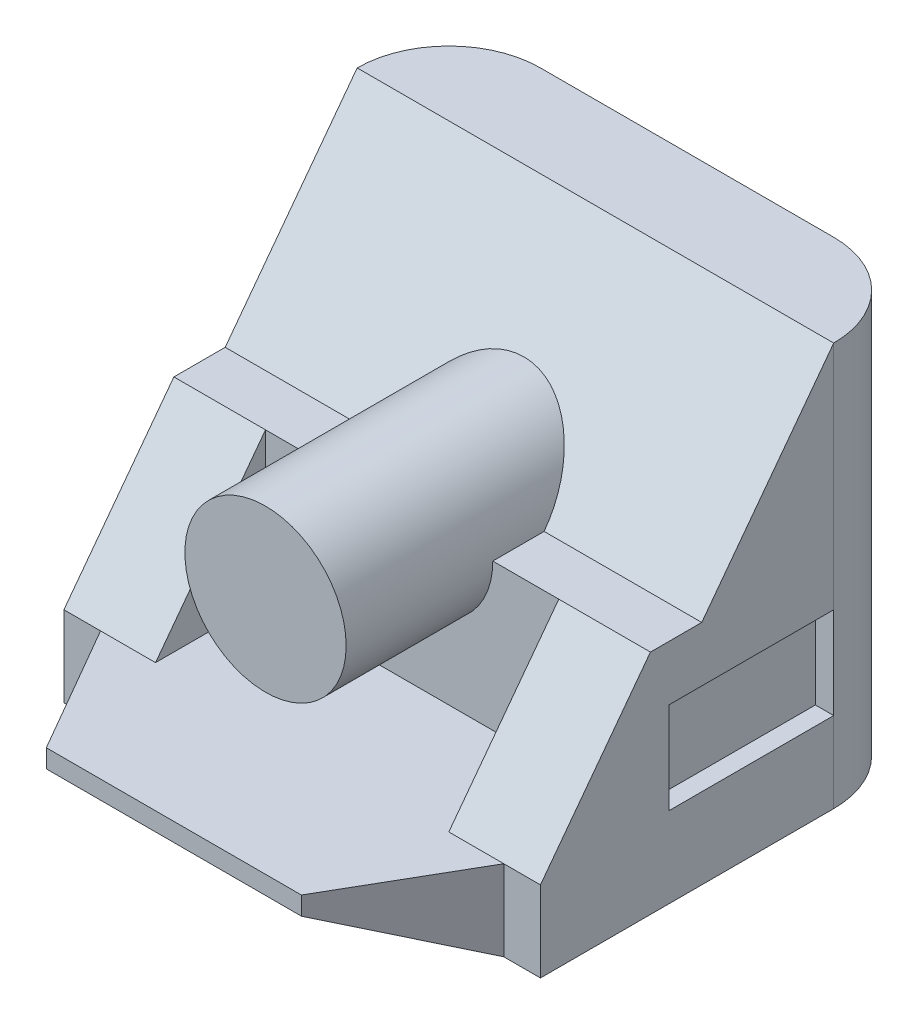
ISO-10303-21;
HEADER;
FILE_DESCRIPTION(('STEP AP214'),'2;1');
FILE_NAME('part.step','',(''),(''),'','','');
FILE_SCHEMA(('AUTOMOTIVE_DESIGN { 1 0 10303 214 1 1 1 1 }'));
ENDSEC;
DATA;
#1=APPLICATION_CONTEXT('core data for automotive mechanical design processes');
#2=APPLICATION_PROTOCOL_DEFINITION('international standard','automotive_design',2000,#1);
#3=PRODUCT_CONTEXT('',#1,'mechanical');
#4=PRODUCT('Part','Part','',(#3));
#5=PRODUCT_RELATED_PRODUCT_CATEGORY('part','',(#4));
#6=PRODUCT_DEFINITION_FORMATION('','',#4);
#7=PRODUCT_DEFINITION_CONTEXT('part definition',#1,'design');
#8=PRODUCT_DEFINITION('design','',#6,#7);
#9=PRODUCT_DEFINITION_SHAPE('','',#8);
#10=(LENGTH_UNIT() NAMED_UNIT(*) SI_UNIT(.MILLI.,.METRE.));
#11=(NAMED_UNIT(*) PLANE_ANGLE_UNIT() SI_UNIT($,.RADIAN.));
#12=(NAMED_UNIT(*) SI_UNIT($,.STERADIAN.) SOLID_ANGLE_UNIT());
#13=UNCERTAINTY_MEASURE_WITH_UNIT(LENGTH_MEASURE(1.E-05),#10,'distance_accuracy_value','');
#14=(GEOMETRIC_REPRESENTATION_CONTEXT(3) GLOBAL_UNCERTAINTY_ASSIGNED_CONTEXT((#13)) GLOBAL_UNIT_ASSIGNED_CONTEXT((#10,
#11,#12)) REPRESENTATION_CONTEXT('',''));
#15=CARTESIAN_POINT('',(0.,0.,0.));
#16=DIRECTION('',(0.,0.,1.));
#17=DIRECTION('',(1.,0.,0.));
#18=AXIS2_PLACEMENT_3D('',#15,#16,#17);
#19=CARTESIAN_POINT('',(130.,62.,61.));
#20=DIRECTION('',(0.,-1.,0.));
#21=DIRECTION('',(0.,0.,-1.));
#22=AXIS2_PLACEMENT_3D('',#19,#20,#21);
#23=PLANE('',#22);
#24=DIRECTION('',(-1.,0.,0.));
#25=VECTOR('',#24,1.);
#26=CARTESIAN_POINT('',(130.,62.,61.));
#27=LINE('',#26,#25);
#28=CARTESIAN_POINT('',(130.,62.,61.));
#29=VERTEX_POINT('',#28);
#30=CARTESIAN_POINT('',(87.,62.,61.));
#31=VERTEX_POINT('',#30);
#32=EDGE_CURVE('E190',#29,#31,#27,.T.);
#33=ORIENTED_EDGE('',*,*,#32,.T.);
#34=DIRECTION('',(0.,0.,1.));
#35=VECTOR('',#34,1.);
#36=CARTESIAN_POINT('',(87.,62.,-9.00357133746817));
#37=LINE('',#36,#35);
#38=CARTESIAN_POINT('',(87.,62.,75.));
#39=VERTEX_POINT('',#38);
#40=EDGE_CURVE('E173',#31,#39,#37,.T.);
#41=ORIENTED_EDGE('',*,*,#40,.T.);
#42=DIRECTION('',(-1.,0.,0.));
#43=VECTOR('',#42,1.);
#44=CARTESIAN_POINT('',(25.,62.,75.));
#45=LINE('',#44,#43);
#46=CARTESIAN_POINT('',(105.,62.,75.));
#47=VERTEX_POINT('',#46);
#48=EDGE_CURVE('E354',#47,#39,#45,.T.);
#49=ORIENTED_EDGE('',*,*,#48,.F.);
#50=DIRECTION('',(-1.,0.,0.));
#51=VECTOR('',#50,1.);
#52=CARTESIAN_POINT('',(130.,62.,75.));
#53=LINE('',#52,#51);
#54=CARTESIAN_POINT('',(130.,62.,75.));
#55=VERTEX_POINT('',#54);
#56=EDGE_CURVE('E203',#55,#47,#53,.T.);
#57=ORIENTED_EDGE('',*,*,#56,.F.);
#58=DIRECTION('',(0.,0.,1.));
#59=VECTOR('',#58,1.);
#60=CARTESIAN_POINT('',(130.,62.,61.));
#61=LINE('',#60,#59);
#62=EDGE_CURVE('E197',#29,#55,#61,.T.);
#63=ORIENTED_EDGE('',*,*,#62,.F.);
#64=EDGE_LOOP('',(#33,#41,#49,#57,#63));
#65=FACE_BOUND('',#64,.T.);
#66=ADVANCED_FACE('F31',(#65),#23,.F.);
#67=CARTESIAN_POINT('',(25.,-63.4400374531753,75.0000000000001));
#68=DIRECTION('',(0.,0.,-1.));
#69=DIRECTION('',(0.,1.,0.));
#70=AXIS2_PLACEMENT_3D('',#67,#68,#69);
#71=PLANE('',#70);
#72=CARTESIAN_POINT('',(65.,62.,75.));
#73=DIRECTION('',(0.,0.,-1.));
#74=DIRECTION('',(0.,1.,0.));
#75=AXIS2_PLACEMENT_3D('',#72,#73,#74);
#76=CIRCLE('',#75,22.);
#77=CARTESIAN_POINT('',(43.,62.,75.));
#78=VERTEX_POINT('',#77);
#79=EDGE_CURVE('E11',#39,#78,#76,.T.);
#80=ORIENTED_EDGE('',*,*,#79,.T.);
#81=CARTESIAN_POINT('',(25.,62.,75.));
#82=VERTEX_POINT('',#81);
#83=EDGE_CURVE('E358',#78,#82,#45,.T.);
#84=ORIENTED_EDGE('',*,*,#83,.T.);
#85=DIRECTION('',(0.,1.,0.));
#86=VECTOR('',#85,1.);
#87=CARTESIAN_POINT('',(25.,-63.4400374531753,75.0000000000001));
#88=LINE('',#87,#86);
#89=CARTESIAN_POINT('',(25.,22.,75.));
#90=VERTEX_POINT('',#89);
#91=EDGE_CURVE('E350',#90,#82,#88,.T.);
#92=ORIENTED_EDGE('',*,*,#91,.F.);
#93=DIRECTION('',(-1.,0.,0.));
#94=VECTOR('',#93,1.);
#95=CARTESIAN_POINT('',(25.,22.,75.));
#96=LINE('',#95,#94);
#97=CARTESIAN_POINT('',(105.,22.,75.));
#98=VERTEX_POINT('',#97);
#99=EDGE_CURVE('E349',#98,#90,#96,.T.);
#100=ORIENTED_EDGE('',*,*,#99,.F.);
#101=DIRECTION('',(0.,1.,0.));
#102=VECTOR('',#101,1.);
#103=CARTESIAN_POINT('',(105.,-63.4400374531753,75.0000000000001));
#104=LINE('',#103,#102);
#105=EDGE_CURVE('E347',#98,#47,#104,.T.);
#106=ORIENTED_EDGE('',*,*,#105,.T.);
#107=ORIENTED_EDGE('',*,*,#48,.T.);
#108=EDGE_LOOP('',(#80,#84,#92,#100,#106,#107));
#109=FACE_BOUND('',#108,.T.);
#110=ADVANCED_FACE('F379',(#109),#71,.F.);
#111=CARTESIAN_POINT('',(130.,62.,75.));
#112=DIRECTION('',(0.,-0.6,-0.8));
#113=DIRECTION('',(0.,0.8,-0.6));
#114=AXIS2_PLACEMENT_3D('',#111,#112,#113);
#115=PLANE('',#114);
#116=ORIENTED_EDGE('',*,*,#56,.T.);
#117=DIRECTION('',(0.,-0.8,0.6));
#118=VECTOR('',#117,1.);
#119=CARTESIAN_POINT('',(105.,62.,75.));
#120=LINE('',#119,#118);
#121=CARTESIAN_POINT('',(105.,22.,105.));
#122=VERTEX_POINT('',#121);
#123=EDGE_CURVE('E40',#47,#122,#120,.T.);
#124=ORIENTED_EDGE('',*,*,#123,.T.);
#125=DIRECTION('',(-1.,0.,0.));
#126=VECTOR('',#125,1.);
#127=CARTESIAN_POINT('',(130.,22.,105.));
#128=LINE('',#127,#126);
#129=CARTESIAN_POINT('',(120.,22.,105.));
#130=VERTEX_POINT('',#129);
#131=EDGE_CURVE('E252',#130,#122,#128,.T.);
#132=ORIENTED_EDGE('',*,*,#131,.F.);
#133=CARTESIAN_POINT('',(130.,22.,105.));
#134=VERTEX_POINT('',#133);
#135=EDGE_CURVE('E263',#134,#130,#128,.T.);
#136=ORIENTED_EDGE('',*,*,#135,.F.);
#137=DIRECTION('',(0.,-0.8,0.6));
#138=VECTOR('',#137,1.);
#139=CARTESIAN_POINT('',(130.,62.,75.));
#140=LINE('',#139,#138);
#141=EDGE_CURVE('E291',#55,#134,#140,.T.);
#142=ORIENTED_EDGE('',*,*,#141,.F.);
#143=EDGE_LOOP('',(#116,#124,#132,#136,#142));
#144=FACE_BOUND('',#143,.T.);
#145=ADVANCED_FACE('F250',(#144),#115,.F.);
#146=CARTESIAN_POINT('',(130.,0.,105.));
#147=DIRECTION('',(0.,1.,0.));
#148=DIRECTION('',(0.,0.,1.));
#149=AXIS2_PLACEMENT_3D('',#146,#147,#148);
#150=PLANE('',#149);
#151=DIRECTION('',(0.,0.,-1.));
#152=VECTOR('',#151,1.);
#153=CARTESIAN_POINT('',(0.,0.,105.));
#154=LINE('',#153,#152);
#155=CARTESIAN_POINT('',(0.,0.,105.));
#156=VERTEX_POINT('',#155);
#157=CARTESIAN_POINT('',(0.,0.,25.));
#158=VERTEX_POINT('',#157);
#159=EDGE_CURVE('E287',#156,#158,#154,.T.);
#160=ORIENTED_EDGE('',*,*,#159,.T.);
#161=CARTESIAN_POINT('',(25.,0.,25.));
#162=DIRECTION('',(0.,1.,0.));
#163=DIRECTION('',(0.,0.,1.));
#164=AXIS2_PLACEMENT_3D('',#161,#162,#163);
#165=CIRCLE('',#164,25.);
#166=CARTESIAN_POINT('',(25.,0.,0.));
#167=VERTEX_POINT('',#166);
#168=EDGE_CURVE('E225',#158,#167,#165,.F.);
#169=ORIENTED_EDGE('',*,*,#168,.T.);
#170=DIRECTION('',(-1.,0.,0.));
#171=VECTOR('',#170,1.);
#172=CARTESIAN_POINT('',(130.,0.,0.));
#173=LINE('',#172,#171);
#174=CARTESIAN_POINT('',(105.,0.,0.));
#175=VERTEX_POINT('',#174);
#176=EDGE_CURVE('E209',#175,#167,#173,.T.);
#177=ORIENTED_EDGE('',*,*,#176,.F.);
#178=CARTESIAN_POINT('',(105.,0.,25.));
#179=DIRECTION('',(0.,1.,0.));
#180=DIRECTION('',(0.,0.,1.));
#181=AXIS2_PLACEMENT_3D('',#178,#179,#180);
#182=CIRCLE('',#181,25.);
#183=CARTESIAN_POINT('',(130.,0.,25.));
#184=VERTEX_POINT('',#183);
#185=EDGE_CURVE('E223',#175,#184,#182,.F.);
#186=ORIENTED_EDGE('',*,*,#185,.T.);
#187=DIRECTION('',(0.,0.,-1.));
#188=VECTOR('',#187,1.);
#189=CARTESIAN_POINT('',(130.,0.,105.));
#190=LINE('',#189,#188);
#191=CARTESIAN_POINT('',(130.,0.,105.));
#192=VERTEX_POINT('',#191);
#193=EDGE_CURVE('E281',#192,#184,#190,.T.);
#194=ORIENTED_EDGE('',*,*,#193,.F.);
#195=DIRECTION('',(-1.,0.,0.));
#196=VECTOR('',#195,1.);
#197=CARTESIAN_POINT('',(130.,0.,105.));
#198=LINE('',#197,#196);
#199=CARTESIAN_POINT('',(120.,0.,105.));
#200=VERTEX_POINT('',#199);
#201=EDGE_CURVE('E274',#192,#200,#198,.T.);
#202=ORIENTED_EDGE('',*,*,#201,.T.);
#203=CARTESIAN_POINT('',(9.99999999999999,0.,105.));
#204=VERTEX_POINT('',#203);
#205=EDGE_CURVE('E277',#200,#204,#198,.T.);
#206=ORIENTED_EDGE('',*,*,#205,.T.);
#207=DIRECTION('',(-1.,0.,0.));
#208=VECTOR('',#207,1.);
#209=CARTESIAN_POINT('',(130.,0.,105.));
#210=LINE('',#209,#208);
#211=EDGE_CURVE('E304',#204,#156,#210,.T.);
#212=ORIENTED_EDGE('',*,*,#211,.T.);
#213=EDGE_LOOP('',(#160,#169,#177,#186,#194,#202,#206,#212));
#214=FACE_BOUND('',#213,.T.);
#215=ADVANCED_FACE('F548',(#214),#150,.F.);
#216=CARTESIAN_POINT('',(130.,0.,0.));
#217=DIRECTION('',(0.,0.,1.));
#218=DIRECTION('',(1.,0.,0.));
#219=AXIS2_PLACEMENT_3D('',#216,#217,#218);
#220=PLANE('',#219);
#221=ORIENTED_EDGE('',*,*,#176,.T.);
#222=DIRECTION('',(0.,1.,0.));
#223=VECTOR('',#222,1.);
#224=CARTESIAN_POINT('',(25.,0.,0.));
#225=LINE('',#224,#223);
#226=CARTESIAN_POINT('',(25.,110.,0.));
#227=VERTEX_POINT('',#226);
#228=EDGE_CURVE('E214',#167,#227,#225,.T.);
#229=ORIENTED_EDGE('',*,*,#228,.T.);
#230=DIRECTION('',(-1.,0.,0.));
#231=VECTOR('',#230,1.);
#232=CARTESIAN_POINT('',(130.,110.,0.));
#233=LINE('',#232,#231);
#234=CARTESIAN_POINT('',(105.,110.,0.));
#235=VERTEX_POINT('',#234);
#236=EDGE_CURVE('E201',#235,#227,#233,.T.);
#237=ORIENTED_EDGE('',*,*,#236,.F.);
#238=DIRECTION('',(0.,1.,0.));
#239=VECTOR('',#238,1.);
#240=CARTESIAN_POINT('',(105.,0.,0.));
#241=LINE('',#240,#239);
#242=EDGE_CURVE('E212',#235,#175,#241,.F.);
#243=ORIENTED_EDGE('',*,*,#242,.T.);
#244=EDGE_LOOP('',(#221,#229,#237,#243));
#245=FACE_BOUND('',#244,.T.);
#246=ADVANCED_FACE('F632',(#245),#220,.F.);
#247=CARTESIAN_POINT('',(130.,110.,0.));
#248=DIRECTION('',(0.,-1.,0.));
#249=DIRECTION('',(0.,0.,-1.));
#250=AXIS2_PLACEMENT_3D('',#247,#248,#249);
#251=PLANE('',#250);
#252=ORIENTED_EDGE('',*,*,#236,.T.);
#253=CARTESIAN_POINT('',(25.,110.,25.));
#254=DIRECTION('',(0.,-1.,0.));
#255=DIRECTION('',(0.,0.,-1.));
#256=AXIS2_PLACEMENT_3D('',#253,#254,#255);
#257=CIRCLE('',#256,25.);
#258=CARTESIAN_POINT('',(0.,110.,25.));
#259=VERTEX_POINT('',#258);
#260=EDGE_CURVE('E219',#227,#259,#257,.F.);
#261=ORIENTED_EDGE('',*,*,#260,.T.);
#262=DIRECTION('',(-1.,0.,0.));
#263=VECTOR('',#262,1.);
#264=CARTESIAN_POINT('',(130.,110.,25.));
#265=LINE('',#264,#263);
#266=CARTESIAN_POINT('',(130.,110.,25.));
#267=VERTEX_POINT('',#266);
#268=EDGE_CURVE('E198',#267,#259,#265,.T.);
#269=ORIENTED_EDGE('',*,*,#268,.F.);
#270=CARTESIAN_POINT('',(105.,110.,25.));
#271=DIRECTION('',(0.,-1.,0.));
#272=DIRECTION('',(0.,0.,-1.));
#273=AXIS2_PLACEMENT_3D('',#270,#271,#272);
#274=CIRCLE('',#273,25.);
#275=EDGE_CURVE('E217',#267,#235,#274,.F.);
#276=ORIENTED_EDGE('',*,*,#275,.T.);
#277=EDGE_LOOP('',(#252,#261,#269,#276));
#278=FACE_BOUND('',#277,.T.);
#279=ADVANCED_FACE('F397',(#278),#251,.F.);
#280=CARTESIAN_POINT('',(130.,110.,25.));
#281=DIRECTION('',(0.,-0.6,-0.8));
#282=DIRECTION('',(0.,0.8,-0.6));
#283=AXIS2_PLACEMENT_3D('',#280,#281,#282);
#284=PLANE('',#283);
#285=CARTESIAN_POINT('',(43.,62.,61.));
#286=VERTEX_POINT('',#285);
#287=CARTESIAN_POINT('',(0.,62.,61.));
#288=VERTEX_POINT('',#287);
#289=EDGE_CURVE('E193',#286,#288,#27,.T.);
#290=ORIENTED_EDGE('',*,*,#289,.F.);
#291=CARTESIAN_POINT('',(65.,62.,61.));
#292=DIRECTION('',(0.,-0.6,-0.8));
#293=DIRECTION('',(0.,-0.8,0.6));
#294=AXIS2_PLACEMENT_3D('',#291,#292,#293);
#295=ELLIPSE('',#294,27.5,22.);
#296=EDGE_CURVE('E177',#31,#286,#295,.F.);
#297=ORIENTED_EDGE('',*,*,#296,.F.);
#298=ORIENTED_EDGE('',*,*,#32,.F.);
#299=DIRECTION('',(0.,-0.8,0.6));
#300=VECTOR('',#299,1.);
#301=CARTESIAN_POINT('',(130.,110.,25.));
#302=LINE('',#301,#300);
#303=EDGE_CURVE('E295',#267,#29,#302,.T.);
#304=ORIENTED_EDGE('',*,*,#303,.F.);
#305=ORIENTED_EDGE('',*,*,#268,.T.);
#306=DIRECTION('',(0.,-0.8,0.6));
#307=VECTOR('',#306,1.);
#308=CARTESIAN_POINT('',(0.,110.,25.));
#309=LINE('',#308,#307);
#310=EDGE_CURVE('E285',#259,#288,#309,.T.);
#311=ORIENTED_EDGE('',*,*,#310,.T.);
#312=EDGE_LOOP('',(#290,#297,#298,#304,#305,#311));
#313=FACE_BOUND('',#312,.T.);
#314=ADVANCED_FACE('F188',(#313),#284,.F.);
#315=ORIENTED_EDGE('',*,*,#83,.F.);
#316=DIRECTION('',(0.,0.,1.));
#317=VECTOR('',#316,1.);
#318=CARTESIAN_POINT('',(43.,62.,-9.00357133746817));
#319=LINE('',#318,#317);
#320=EDGE_CURVE('E183',#78,#286,#319,.F.);
#321=ORIENTED_EDGE('',*,*,#320,.T.);
#322=ORIENTED_EDGE('',*,*,#289,.T.);
#323=DIRECTION('',(0.,0.,1.));
#324=VECTOR('',#323,1.);
#325=CARTESIAN_POINT('',(0.,62.,61.));
#326=LINE('',#325,#324);
#327=CARTESIAN_POINT('',(0.,62.,75.));
#328=VERTEX_POINT('',#327);
#329=EDGE_CURVE('E282',#288,#328,#326,.T.);
#330=ORIENTED_EDGE('',*,*,#329,.T.);
#331=EDGE_CURVE('E266',#82,#328,#53,.T.);
#332=ORIENTED_EDGE('',*,*,#331,.F.);
#333=EDGE_LOOP('',(#315,#321,#322,#330,#332));
#334=FACE_BOUND('',#333,.T.);
#335=ADVANCED_FACE('F381',(#334),#23,.F.);
#336=CARTESIAN_POINT('',(25.,22.,105.));
#337=VERTEX_POINT('',#336);
#338=CARTESIAN_POINT('',(9.99999999999999,22.,105.));
#339=VERTEX_POINT('',#338);
#340=EDGE_CURVE('E264',#337,#339,#128,.T.);
#341=ORIENTED_EDGE('',*,*,#340,.F.);
#342=DIRECTION('',(0.,0.8,-0.6));
#343=VECTOR('',#342,1.);
#344=CARTESIAN_POINT('',(25.,62.,75.));
#345=LINE('',#344,#343);
#346=EDGE_CURVE('E242',#337,#82,#345,.T.);
#347=ORIENTED_EDGE('',*,*,#346,.T.);
#348=ORIENTED_EDGE('',*,*,#331,.T.);
#349=DIRECTION('',(0.,-0.8,0.6));
#350=VECTOR('',#349,1.);
#351=CARTESIAN_POINT('',(0.,62.,75.));
#352=LINE('',#351,#350);
#353=CARTESIAN_POINT('',(0.,22.,105.));
#354=VERTEX_POINT('',#353);
#355=EDGE_CURVE('E278',#328,#354,#352,.T.);
#356=ORIENTED_EDGE('',*,*,#355,.T.);
#357=DIRECTION('',(-1.,0.,0.));
#358=VECTOR('',#357,1.);
#359=CARTESIAN_POINT('',(0.,22.,105.));
#360=LINE('',#359,#358);
#361=EDGE_CURVE('E315',#339,#354,#360,.T.);
#362=ORIENTED_EDGE('',*,*,#361,.F.);
#363=EDGE_LOOP('',(#341,#347,#348,#356,#362));
#364=FACE_BOUND('',#363,.T.);
#365=ADVANCED_FACE('F390',(#364),#115,.F.);
#366=CARTESIAN_POINT('',(130.,22.,105.));
#367=DIRECTION('',(0.,-1.,0.));
#368=DIRECTION('',(0.,0.,-1.));
#369=AXIS2_PLACEMENT_3D('',#366,#367,#368);
#370=PLANE('',#369);
#371=ORIENTED_EDGE('',*,*,#131,.T.);
#372=DIRECTION('',(0.,0.,-1.));
#373=VECTOR('',#372,1.);
#374=CARTESIAN_POINT('',(105.,22.,75.0000000000001));
#375=LINE('',#374,#373);
#376=EDGE_CURVE('E260',#122,#98,#375,.T.);
#377=ORIENTED_EDGE('',*,*,#376,.T.);
#378=ORIENTED_EDGE('',*,*,#99,.T.);
#379=DIRECTION('',(0.,0.,1.));
#380=VECTOR('',#379,1.);
#381=CARTESIAN_POINT('',(25.,22.,75.0000000000001));
#382=LINE('',#381,#380);
#383=EDGE_CURVE('E47',#90,#337,#382,.T.);
#384=ORIENTED_EDGE('',*,*,#383,.T.);
#385=ORIENTED_EDGE('',*,*,#340,.T.);
#386=DIRECTION('',(-0.500000000000004,0.,-0.866025403784436));
#387=VECTOR('',#386,1.);
#388=CARTESIAN_POINT('',(9.99999999999999,22.,105.));
#389=LINE('',#388,#387);
#390=CARTESIAN_POINT('',(30.2072594216371,22.,140.));
#391=VERTEX_POINT('',#390);
#392=EDGE_CURVE('E310',#391,#339,#389,.T.);
#393=ORIENTED_EDGE('',*,*,#392,.F.);
#394=DIRECTION('',(-1.,0.,0.));
#395=VECTOR('',#394,1.);
#396=CARTESIAN_POINT('',(130.,22.,140.));
#397=LINE('',#396,#395);
#398=CARTESIAN_POINT('',(99.7927405783629,22.,140.));
#399=VERTEX_POINT('',#398);
#400=EDGE_CURVE('E267',#399,#391,#397,.T.);
#401=ORIENTED_EDGE('',*,*,#400,.F.);
#402=DIRECTION('',(-0.500000000000004,0.,0.866025403784436));
#403=VECTOR('',#402,1.);
#404=CARTESIAN_POINT('',(120.,22.,105.));
#405=LINE('',#404,#403);
#406=EDGE_CURVE('E262',#130,#399,#405,.T.);
#407=ORIENTED_EDGE('',*,*,#406,.F.);
#408=EDGE_LOOP('',(#371,#377,#378,#384,#385,#393,#401,#407));
#409=FACE_BOUND('',#408,.T.);
#410=ADVANCED_FACE('F259',(#409),#370,.F.);
#411=CARTESIAN_POINT('',(130.,22.,140.));
#412=DIRECTION('',(0.,0.,-1.));
#413=DIRECTION('',(-1.,0.,0.));
#414=AXIS2_PLACEMENT_3D('',#411,#412,#413);
#415=PLANE('',#414);
#416=ORIENTED_EDGE('',*,*,#400,.T.);
#417=DIRECTION('',(0.,1.,0.));
#418=VECTOR('',#417,1.);
#419=CARTESIAN_POINT('',(30.2072594216371,-108.,140.));
#420=LINE('',#419,#418);
#421=CARTESIAN_POINT('',(30.2072594216371,17.,140.));
#422=VERTEX_POINT('',#421);
#423=EDGE_CURVE('E308',#422,#391,#420,.T.);
#424=ORIENTED_EDGE('',*,*,#423,.F.);
#425=DIRECTION('',(-1.,0.,0.));
#426=VECTOR('',#425,1.);
#427=CARTESIAN_POINT('',(130.,17.,140.));
#428=LINE('',#427,#426);
#429=CARTESIAN_POINT('',(99.7927405783629,17.,140.));
#430=VERTEX_POINT('',#429);
#431=EDGE_CURVE('E271',#430,#422,#428,.T.);
#432=ORIENTED_EDGE('',*,*,#431,.F.);
#433=DIRECTION('',(0.,1.,0.));
#434=VECTOR('',#433,1.);
#435=CARTESIAN_POINT('',(99.7927405783629,-108.,140.));
#436=LINE('',#435,#434);
#437=EDGE_CURVE('E299',#430,#399,#436,.T.);
#438=ORIENTED_EDGE('',*,*,#437,.T.);
#439=EDGE_LOOP('',(#416,#424,#432,#438));
#440=FACE_BOUND('',#439,.T.);
#441=ADVANCED_FACE('F412',(#440),#415,.F.);
#442=CARTESIAN_POINT('',(130.,17.,140.));
#443=DIRECTION('',(0.,0.899508158575998,-0.436903962736913));
#444=DIRECTION('',(0.,0.436903962736913,0.899508158575998));
#445=AXIS2_PLACEMENT_3D('',#442,#443,#444);
#446=PLANE('',#445);
#447=ORIENTED_EDGE('',*,*,#431,.T.);
#448=DIRECTION('',(-0.460885525173043,-0.387734613806772,-0.798277146072767));
#449=VECTOR('',#448,1.);
#450=CARTESIAN_POINT('',(51.404781046138,34.8330895891136,176.715184448175));
#451=LINE('',#450,#449);
#452=EDGE_CURVE('E239',#422,#204,#451,.T.);
#453=ORIENTED_EDGE('',*,*,#452,.T.);
#454=ORIENTED_EDGE('',*,*,#205,.F.);
#455=DIRECTION('',(-0.460885525173043,0.387734613806772,0.798277146072767));
#456=VECTOR('',#455,1.);
#457=CARTESIAN_POINT('',(106.209229704686,11.6019243445404,128.886314826995));
#458=LINE('',#457,#456);
#459=EDGE_CURVE('E233',#200,#430,#458,.T.);
#460=ORIENTED_EDGE('',*,*,#459,.T.);
#461=EDGE_LOOP('',(#447,#453,#454,#460));
#462=FACE_BOUND('',#461,.T.);
#463=ADVANCED_FACE('F414',(#462),#446,.F.);
#464=CARTESIAN_POINT('',(130.,0.,0.));
#465=DIRECTION('',(1.,0.,0.));
#466=DIRECTION('',(0.,0.,-1.));
#467=AXIS2_PLACEMENT_3D('',#464,#465,#466);
#468=PLANE('',#467);
#469=DIRECTION('',(0.,0.,-1.));
#470=VECTOR('',#469,1.);
#471=CARTESIAN_POINT('',(130.,22.,25.));
#472=LINE('',#471,#470);
#473=CARTESIAN_POINT('',(130.,22.,70.));
#474=VERTEX_POINT('',#473);
#475=CARTESIAN_POINT('',(130.,22.,25.));
#476=VERTEX_POINT('',#475);
#477=EDGE_CURVE('E55',#474,#476,#472,.T.);
#478=ORIENTED_EDGE('',*,*,#477,.F.);
#479=DIRECTION('',(0.,-1.,0.));
#480=VECTOR('',#479,1.);
#481=CARTESIAN_POINT('',(130.,47.,70.));
#482=LINE('',#481,#480);
#483=CARTESIAN_POINT('',(130.,47.,70.));
#484=VERTEX_POINT('',#483);
#485=EDGE_CURVE('E328',#484,#474,#482,.T.);
#486=ORIENTED_EDGE('',*,*,#485,.F.);
#487=DIRECTION('',(0.,0.,1.));
#488=VECTOR('',#487,1.);
#489=CARTESIAN_POINT('',(130.,47.,25.));
#490=LINE('',#489,#488);
#491=CARTESIAN_POINT('',(130.,47.,25.));
#492=VERTEX_POINT('',#491);
#493=EDGE_CURVE('E331',#492,#484,#490,.T.);
#494=ORIENTED_EDGE('',*,*,#493,.F.);
#495=DIRECTION('',(0.,1.,0.));
#496=VECTOR('',#495,1.);
#497=CARTESIAN_POINT('',(130.,110.,25.));
#498=LINE('',#497,#496);
#499=EDGE_CURVE('E227',#492,#267,#498,.T.);
#500=ORIENTED_EDGE('',*,*,#499,.T.);
#501=ORIENTED_EDGE('',*,*,#303,.T.);
#502=ORIENTED_EDGE('',*,*,#62,.T.);
#503=ORIENTED_EDGE('',*,*,#141,.T.);
#504=DIRECTION('',(0.,1.,0.));
#505=VECTOR('',#504,1.);
#506=CARTESIAN_POINT('',(130.,0.,105.));
#507=LINE('',#506,#505);
#508=EDGE_CURVE('E231',#192,#134,#507,.T.);
#509=ORIENTED_EDGE('',*,*,#508,.F.);
#510=ORIENTED_EDGE('',*,*,#193,.T.);
#511=EDGE_CURVE('E228',#184,#476,#498,.T.);
#512=ORIENTED_EDGE('',*,*,#511,.T.);
#513=EDGE_LOOP('',(#478,#486,#494,#500,#501,#502,#503,#509,#510,#512));
#514=FACE_BOUND('',#513,.T.);
#515=ADVANCED_FACE('F424',(#514),#468,.T.);
#516=CARTESIAN_POINT('',(0.,0.,0.));
#517=DIRECTION('',(1.,0.,0.));
#518=DIRECTION('',(0.,0.,-1.));
#519=AXIS2_PLACEMENT_3D('',#516,#517,#518);
#520=PLANE('',#519);
#521=ORIENTED_EDGE('',*,*,#159,.F.);
#522=DIRECTION('',(0.,1.,0.));
#523=VECTOR('',#522,1.);
#524=CARTESIAN_POINT('',(0.,0.,105.));
#525=LINE('',#524,#523);
#526=EDGE_CURVE('E236',#156,#354,#525,.T.);
#527=ORIENTED_EDGE('',*,*,#526,.T.);
#528=ORIENTED_EDGE('',*,*,#355,.F.);
#529=ORIENTED_EDGE('',*,*,#329,.F.);
#530=ORIENTED_EDGE('',*,*,#310,.F.);
#531=DIRECTION('',(0.,1.,0.));
#532=VECTOR('',#531,1.);
#533=CARTESIAN_POINT('',(0.,0.,25.));
#534=LINE('',#533,#532);
#535=EDGE_CURVE('E221',#259,#158,#534,.F.);
#536=ORIENTED_EDGE('',*,*,#535,.T.);
#537=EDGE_LOOP('',(#521,#527,#528,#529,#530,#536));
#538=FACE_BOUND('',#537,.T.);
#539=ADVANCED_FACE('F460',(#538),#520,.F.);
#540=CARTESIAN_POINT('',(25.,0.,25.));
#541=DIRECTION('',(0.,1.,0.));
#542=DIRECTION('',(0.,0.,1.));
#543=AXIS2_PLACEMENT_3D('',#540,#541,#542);
#544=CYLINDRICAL_SURFACE('',#543,25.);
#545=ORIENTED_EDGE('',*,*,#168,.F.);
#546=ORIENTED_EDGE('',*,*,#535,.F.);
#547=ORIENTED_EDGE('',*,*,#260,.F.);
#548=ORIENTED_EDGE('',*,*,#228,.F.);
#549=EDGE_LOOP('',(#545,#546,#547,#548));
#550=FACE_BOUND('',#549,.T.);
#551=ADVANCED_FACE('F463',(#550),#544,.T.);
#552=CARTESIAN_POINT('',(105.,0.,25.));
#553=DIRECTION('',(0.,-1.,0.));
#554=DIRECTION('',(0.,0.,-1.));
#555=AXIS2_PLACEMENT_3D('',#552,#553,#554);
#556=CYLINDRICAL_SURFACE('',#555,25.);
#557=ORIENTED_EDGE('',*,*,#185,.F.);
#558=ORIENTED_EDGE('',*,*,#242,.F.);
#559=ORIENTED_EDGE('',*,*,#275,.F.);
#560=ORIENTED_EDGE('',*,*,#499,.F.);
#561=DIRECTION('',(0.,1.,0.));
#562=VECTOR('',#561,1.);
#563=CARTESIAN_POINT('',(130.,47.,25.));
#564=LINE('',#563,#562);
#565=EDGE_CURVE('E334',#476,#492,#564,.T.);
#566=ORIENTED_EDGE('',*,*,#565,.F.);
#567=ORIENTED_EDGE('',*,*,#511,.F.);
#568=EDGE_LOOP('',(#557,#558,#559,#560,#566,#567));
#569=FACE_BOUND('',#568,.T.);
#570=ADVANCED_FACE('F33',(#569),#556,.T.);
#571=CARTESIAN_POINT('',(120.,-108.,105.));
#572=DIRECTION('',(-0.866025403784436,0.,-0.500000000000004));
#573=DIRECTION('',(-0.500000000000004,0.,0.866025403784436));
#574=AXIS2_PLACEMENT_3D('',#571,#572,#573);
#575=PLANE('',#574);
#576=DIRECTION('',(0.,1.,0.));
#577=VECTOR('',#576,1.);
#578=CARTESIAN_POINT('',(120.,-108.,105.));
#579=LINE('',#578,#577);
#580=EDGE_CURVE('E290',#200,#130,#579,.T.);
#581=ORIENTED_EDGE('',*,*,#580,.T.);
#582=ORIENTED_EDGE('',*,*,#406,.T.);
#583=ORIENTED_EDGE('',*,*,#437,.F.);
#584=ORIENTED_EDGE('',*,*,#459,.F.);
#585=EDGE_LOOP('',(#581,#582,#583,#584));
#586=FACE_BOUND('',#585,.T.);
#587=ADVANCED_FACE('F419',(#586),#575,.F.);
#588=CARTESIAN_POINT('',(130.,-108.,105.));
#589=DIRECTION('',(0.,0.,-1.));
#590=DIRECTION('',(-1.,0.,0.));
#591=AXIS2_PLACEMENT_3D('',#588,#589,#590);
#592=PLANE('',#591);
#593=ORIENTED_EDGE('',*,*,#508,.T.);
#594=ORIENTED_EDGE('',*,*,#135,.T.);
#595=ORIENTED_EDGE('',*,*,#580,.F.);
#596=ORIENTED_EDGE('',*,*,#201,.F.);
#597=EDGE_LOOP('',(#593,#594,#595,#596));
#598=FACE_BOUND('',#597,.T.);
#599=ADVANCED_FACE('F421',(#598),#592,.F.);
#600=CARTESIAN_POINT('',(9.99999999999999,-108.,105.));
#601=DIRECTION('',(0.866025403784436,0.,-0.500000000000004));
#602=DIRECTION('',(-0.500000000000004,0.,-0.866025403784436));
#603=AXIS2_PLACEMENT_3D('',#600,#601,#602);
#604=PLANE('',#603);
#605=ORIENTED_EDGE('',*,*,#423,.T.);
#606=ORIENTED_EDGE('',*,*,#392,.T.);
#607=DIRECTION('',(0.,1.,0.));
#608=VECTOR('',#607,1.);
#609=CARTESIAN_POINT('',(9.99999999999999,-108.,105.));
#610=LINE('',#609,#608);
#611=EDGE_CURVE('E307',#204,#339,#610,.T.);
#612=ORIENTED_EDGE('',*,*,#611,.F.);
#613=ORIENTED_EDGE('',*,*,#452,.F.);
#614=EDGE_LOOP('',(#605,#606,#612,#613));
#615=FACE_BOUND('',#614,.T.);
#616=ADVANCED_FACE('F408',(#615),#604,.F.);
#617=CARTESIAN_POINT('',(0.,-108.,105.));
#618=DIRECTION('',(0.,0.,-1.));
#619=DIRECTION('',(-1.,0.,0.));
#620=AXIS2_PLACEMENT_3D('',#617,#618,#619);
#621=PLANE('',#620);
#622=ORIENTED_EDGE('',*,*,#611,.T.);
#623=ORIENTED_EDGE('',*,*,#361,.T.);
#624=ORIENTED_EDGE('',*,*,#526,.F.);
#625=ORIENTED_EDGE('',*,*,#211,.F.);
#626=EDGE_LOOP('',(#622,#623,#624,#625));
#627=FACE_BOUND('',#626,.T.);
#628=ADVANCED_FACE('F406',(#627),#621,.F.);
#629=CARTESIAN_POINT('',(125.,47.,25.));
#630=DIRECTION('',(0.,0.,-1.));
#631=DIRECTION('',(0.,1.,0.));
#632=AXIS2_PLACEMENT_3D('',#629,#630,#631);
#633=PLANE('',#632);
#634=ORIENTED_EDGE('',*,*,#565,.T.);
#635=DIRECTION('',(1.,0.,0.));
#636=VECTOR('',#635,1.);
#637=CARTESIAN_POINT('',(125.,47.,25.));
#638=LINE('',#637,#636);
#639=CARTESIAN_POINT('',(125.,47.,25.));
#640=VERTEX_POINT('',#639);
#641=EDGE_CURVE('E318',#640,#492,#638,.T.);
#642=ORIENTED_EDGE('',*,*,#641,.F.);
#643=DIRECTION('',(0.,1.,0.));
#644=VECTOR('',#643,1.);
#645=CARTESIAN_POINT('',(125.,47.,25.));
#646=LINE('',#645,#644);
#647=CARTESIAN_POINT('',(125.,22.,25.));
#648=VERTEX_POINT('',#647);
#649=EDGE_CURVE('E327',#648,#640,#646,.T.);
#650=ORIENTED_EDGE('',*,*,#649,.F.);
#651=DIRECTION('',(1.,0.,0.));
#652=VECTOR('',#651,1.);
#653=CARTESIAN_POINT('',(125.,22.,25.));
#654=LINE('',#653,#652);
#655=EDGE_CURVE('E317',#648,#476,#654,.T.);
#656=ORIENTED_EDGE('',*,*,#655,.T.);
#657=EDGE_LOOP('',(#634,#642,#650,#656));
#658=FACE_BOUND('',#657,.T.);
#659=ADVANCED_FACE('F440',(#658),#633,.F.);
#660=CARTESIAN_POINT('',(125.,22.,25.));
#661=DIRECTION('',(0.,-1.,0.));
#662=DIRECTION('',(0.,0.,-1.));
#663=AXIS2_PLACEMENT_3D('',#660,#661,#662);
#664=PLANE('',#663);
#665=ORIENTED_EDGE('',*,*,#477,.T.);
#666=ORIENTED_EDGE('',*,*,#655,.F.);
#667=DIRECTION('',(0.,0.,-1.));
#668=VECTOR('',#667,1.);
#669=CARTESIAN_POINT('',(125.,22.,25.));
#670=LINE('',#669,#668);
#671=CARTESIAN_POINT('',(125.,22.,70.));
#672=VERTEX_POINT('',#671);
#673=EDGE_CURVE('E321',#672,#648,#670,.T.);
#674=ORIENTED_EDGE('',*,*,#673,.F.);
#675=DIRECTION('',(1.,0.,0.));
#676=VECTOR('',#675,1.);
#677=CARTESIAN_POINT('',(125.,22.,70.));
#678=LINE('',#677,#676);
#679=EDGE_CURVE('E323',#672,#474,#678,.T.);
#680=ORIENTED_EDGE('',*,*,#679,.T.);
#681=EDGE_LOOP('',(#665,#666,#674,#680));
#682=FACE_BOUND('',#681,.T.);
#683=ADVANCED_FACE('F436',(#682),#664,.F.);
#684=CARTESIAN_POINT('',(125.,47.,70.));
#685=DIRECTION('',(0.,0.,1.));
#686=DIRECTION('',(1.,0.,0.));
#687=AXIS2_PLACEMENT_3D('',#684,#685,#686);
#688=PLANE('',#687);
#689=ORIENTED_EDGE('',*,*,#485,.T.);
#690=ORIENTED_EDGE('',*,*,#679,.F.);
#691=DIRECTION('',(0.,-1.,0.));
#692=VECTOR('',#691,1.);
#693=CARTESIAN_POINT('',(125.,47.,70.));
#694=LINE('',#693,#692);
#695=CARTESIAN_POINT('',(125.,47.,70.));
#696=VERTEX_POINT('',#695);
#697=EDGE_CURVE('E339',#696,#672,#694,.T.);
#698=ORIENTED_EDGE('',*,*,#697,.F.);
#699=DIRECTION('',(1.,0.,0.));
#700=VECTOR('',#699,1.);
#701=CARTESIAN_POINT('',(125.,47.,70.));
#702=LINE('',#701,#700);
#703=EDGE_CURVE('E320',#696,#484,#702,.T.);
#704=ORIENTED_EDGE('',*,*,#703,.T.);
#705=EDGE_LOOP('',(#689,#690,#698,#704));
#706=FACE_BOUND('',#705,.T.);
#707=ADVANCED_FACE('F439',(#706),#688,.F.);
#708=CARTESIAN_POINT('',(125.,47.,25.));
#709=DIRECTION('',(0.,1.,0.));
#710=DIRECTION('',(0.,0.,1.));
#711=AXIS2_PLACEMENT_3D('',#708,#709,#710);
#712=PLANE('',#711);
#713=ORIENTED_EDGE('',*,*,#493,.T.);
#714=ORIENTED_EDGE('',*,*,#703,.F.);
#715=DIRECTION('',(0.,0.,1.));
#716=VECTOR('',#715,1.);
#717=CARTESIAN_POINT('',(125.,47.,25.));
#718=LINE('',#717,#716);
#719=EDGE_CURVE('E342',#640,#696,#718,.T.);
#720=ORIENTED_EDGE('',*,*,#719,.F.);
#721=ORIENTED_EDGE('',*,*,#641,.T.);
#722=EDGE_LOOP('',(#713,#714,#720,#721));
#723=FACE_BOUND('',#722,.T.);
#724=ADVANCED_FACE('F432',(#723),#712,.F.);
#725=CARTESIAN_POINT('',(125.,22.,25.));
#726=DIRECTION('',(-1.,0.,0.));
#727=DIRECTION('',(0.,0.,1.));
#728=AXIS2_PLACEMENT_3D('',#725,#726,#727);
#729=PLANE('',#728);
#730=ORIENTED_EDGE('',*,*,#649,.T.);
#731=ORIENTED_EDGE('',*,*,#719,.T.);
#732=ORIENTED_EDGE('',*,*,#697,.T.);
#733=ORIENTED_EDGE('',*,*,#673,.T.);
#734=EDGE_LOOP('',(#730,#731,#732,#733));
#735=FACE_BOUND('',#734,.T.);
#736=ADVANCED_FACE('F427',(#735),#729,.F.);
#737=CARTESIAN_POINT('',(105.,-63.4400374531753,75.0000000000001));
#738=DIRECTION('',(1.,0.,0.));
#739=DIRECTION('',(0.,0.,-1.));
#740=AXIS2_PLACEMENT_3D('',#737,#738,#739);
#741=PLANE('',#740);
#742=ORIENTED_EDGE('',*,*,#105,.F.);
#743=ORIENTED_EDGE('',*,*,#376,.F.);
#744=ORIENTED_EDGE('',*,*,#123,.F.);
#745=EDGE_LOOP('',(#742,#743,#744));
#746=FACE_BOUND('',#745,.T.);
#747=ADVANCED_FACE('F375',(#746),#741,.F.);
#748=CARTESIAN_POINT('',(25.,-63.4400374531753,75.0000000000001));
#749=DIRECTION('',(-1.,0.,0.));
#750=DIRECTION('',(0.,0.,1.));
#751=AXIS2_PLACEMENT_3D('',#748,#749,#750);
#752=PLANE('',#751);
#753=ORIENTED_EDGE('',*,*,#383,.F.);
#754=ORIENTED_EDGE('',*,*,#91,.T.);
#755=ORIENTED_EDGE('',*,*,#346,.F.);
#756=EDGE_LOOP('',(#753,#754,#755));
#757=FACE_BOUND('',#756,.T.);
#758=ADVANCED_FACE('F368',(#757),#752,.F.);
#759=CARTESIAN_POINT('',(65.,62.,-9.00357133746817));
#760=DIRECTION('',(0.,0.,1.));
#761=DIRECTION('',(1.,0.,0.));
#762=AXIS2_PLACEMENT_3D('',#759,#760,#761);
#763=CYLINDRICAL_SURFACE('',#762,22.);
#764=CARTESIAN_POINT('',(65.,62.,115.));
#765=DIRECTION('',(0.,0.,1.));
#766=DIRECTION('',(1.,0.,0.));
#767=AXIS2_PLACEMENT_3D('',#764,#765,#766);
#768=CIRCLE('',#767,22.);
#769=CARTESIAN_POINT('',(87.,62.,115.));
#770=VERTEX_POINT('',#769);
#771=EDGE_CURVE('E194',#770,#770,#768,.T.);
#772=ORIENTED_EDGE('',*,*,#771,.F.);
#773=EDGE_LOOP('',(#772));
#774=FACE_BOUND('',#773,.T.);
#775=ORIENTED_EDGE('',*,*,#320,.F.);
#776=ORIENTED_EDGE('',*,*,#79,.F.);
#777=ORIENTED_EDGE('',*,*,#40,.F.);
#778=ORIENTED_EDGE('',*,*,#296,.T.);
#779=EDGE_LOOP('',(#775,#776,#777,#778));
#780=FACE_BOUND('',#779,.T.);
#781=ADVANCED_FACE('F176',(#774,#780),#763,.T.);
#782=CARTESIAN_POINT('',(65.,62.,115.));
#783=DIRECTION('',(0.,0.,1.));
#784=DIRECTION('',(1.,0.,0.));
#785=AXIS2_PLACEMENT_3D('',#782,#783,#784);
#786=PLANE('',#785);
#787=ORIENTED_EDGE('',*,*,#771,.T.);
#788=EDGE_LOOP('',(#787));
#789=FACE_BOUND('',#788,.T.);
#790=ADVANCED_FACE('F365',(#789),#786,.T.);
#791=CLOSED_SHELL('',(#66,#110,#145,#215,#246,#279,#314,#335,#365,#410,#441,#463,#515,#539,#551,
#570,#587,#599,#616,#628,#659,#683,#707,#724,#736,#747,#758,#781,#790));
#792=MANIFOLD_SOLID_BREP('B2',#791);
#793=ADVANCED_BREP_SHAPE_REPRESENTATION('',(#18,#792),#14);
#794=SHAPE_DEFINITION_REPRESENTATION(#9,#793);
ENDSEC;
END-ISO-10303-21;
